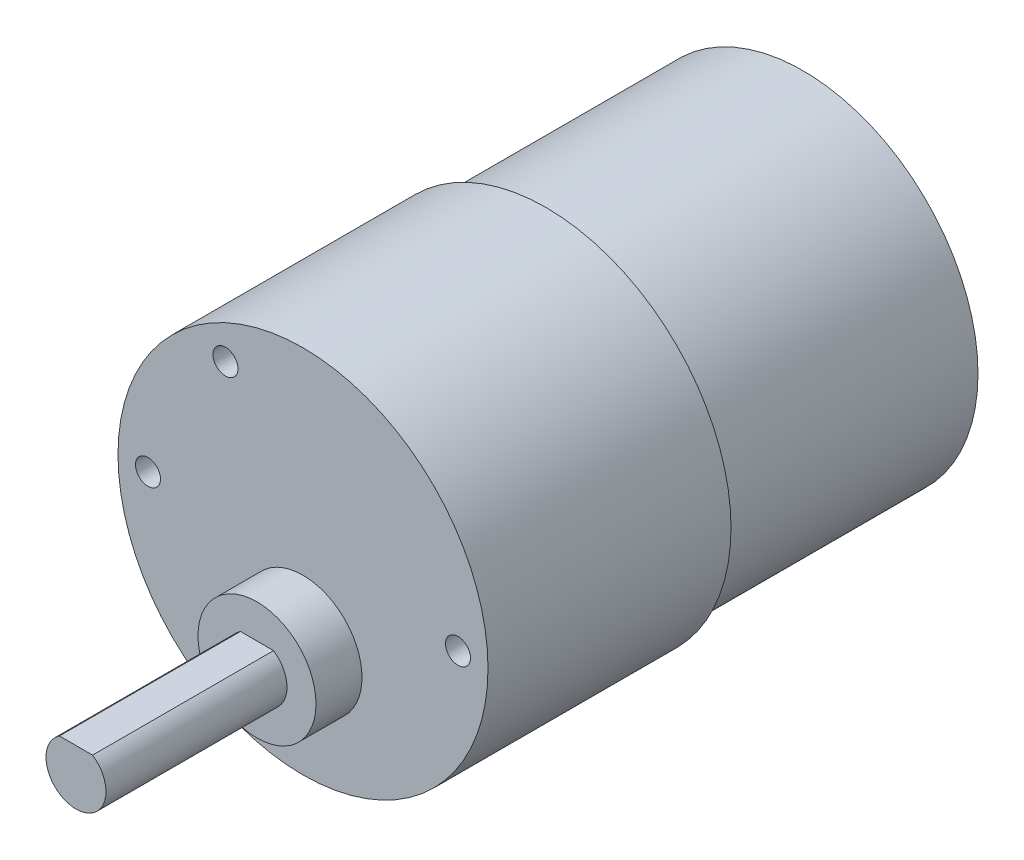
ISO-10303-21;
HEADER;
FILE_DESCRIPTION(('STEP AP214'),'2;1');
FILE_NAME('part.step','',(''),(''),'','','');
FILE_SCHEMA(('AUTOMOTIVE_DESIGN { 1 0 10303 214 1 1 1 1 }'));
ENDSEC;
DATA;
#1=APPLICATION_CONTEXT('core data for automotive mechanical design processes');
#2=APPLICATION_PROTOCOL_DEFINITION('international standard','automotive_design',2000,#1);
#3=PRODUCT_CONTEXT('',#1,'mechanical');
#4=PRODUCT('Part','Part','',(#3));
#5=PRODUCT_RELATED_PRODUCT_CATEGORY('part','',(#4));
#6=PRODUCT_DEFINITION_FORMATION('','',#4);
#7=PRODUCT_DEFINITION_CONTEXT('part definition',#1,'design');
#8=PRODUCT_DEFINITION('design','',#6,#7);
#9=PRODUCT_DEFINITION_SHAPE('','',#8);
#10=(LENGTH_UNIT() NAMED_UNIT(*) SI_UNIT(.MILLI.,.METRE.));
#11=(NAMED_UNIT(*) PLANE_ANGLE_UNIT() SI_UNIT($,.RADIAN.));
#12=(NAMED_UNIT(*) SI_UNIT($,.STERADIAN.) SOLID_ANGLE_UNIT());
#13=UNCERTAINTY_MEASURE_WITH_UNIT(LENGTH_MEASURE(1.E-05),#10,'distance_accuracy_value','');
#14=(GEOMETRIC_REPRESENTATION_CONTEXT(3) GLOBAL_UNCERTAINTY_ASSIGNED_CONTEXT((#13)) GLOBAL_UNIT_ASSIGNED_CONTEXT((#10,
#11,#12)) REPRESENTATION_CONTEXT('',''));
#15=CARTESIAN_POINT('',(0.,0.,0.));
#16=DIRECTION('',(0.,0.,1.));
#17=DIRECTION('',(1.,0.,0.));
#18=AXIS2_PLACEMENT_3D('',#15,#16,#17);
#19=CARTESIAN_POINT('',(0.,0.,0.));
#20=DIRECTION('',(0.,0.,-1.));
#21=DIRECTION('',(-1.,0.,0.));
#22=AXIS2_PLACEMENT_3D('',#19,#20,#21);
#23=PLANE('',#22);
#24=CARTESIAN_POINT('',(-15.5,0.,0.));
#25=DIRECTION('',(0.,0.,1.));
#26=DIRECTION('',(1.,0.,0.));
#27=AXIS2_PLACEMENT_3D('',#24,#25,#26);
#28=CIRCLE('',#27,1.25);
#29=CARTESIAN_POINT('',(-14.25,0.,0.));
#30=VERTEX_POINT('',#29);
#31=EDGE_CURVE('E91',#30,#30,#28,.T.);
#32=ORIENTED_EDGE('',*,*,#31,.F.);
#33=EDGE_LOOP('',(#32));
#34=FACE_BOUND('',#33,.T.);
#35=CARTESIAN_POINT('',(-7.75,13.4233937586588,0.));
#36=DIRECTION('',(0.,0.,1.));
#37=DIRECTION('',(1.,0.,0.));
#38=AXIS2_PLACEMENT_3D('',#35,#36,#37);
#39=CIRCLE('',#38,1.25);
#40=CARTESIAN_POINT('',(-6.5,13.4233937586588,0.));
#41=VERTEX_POINT('',#40);
#42=EDGE_CURVE('E90',#41,#41,#39,.T.);
#43=ORIENTED_EDGE('',*,*,#42,.F.);
#44=EDGE_LOOP('',(#43));
#45=FACE_BOUND('',#44,.T.);
#46=CARTESIAN_POINT('',(-7.75,-13.4233937586588,0.));
#47=DIRECTION('',(0.,0.,1.));
#48=DIRECTION('',(1.,0.,0.));
#49=AXIS2_PLACEMENT_3D('',#46,#47,#48);
#50=CIRCLE('',#49,1.25);
#51=CARTESIAN_POINT('',(-6.5,-13.4233937586588,0.));
#52=VERTEX_POINT('',#51);
#53=EDGE_CURVE('E101',#52,#52,#50,.T.);
#54=ORIENTED_EDGE('',*,*,#53,.F.);
#55=EDGE_LOOP('',(#54));
#56=FACE_BOUND('',#55,.T.);
#57=CARTESIAN_POINT('',(15.5,0.,0.));
#58=DIRECTION('',(0.,0.,1.));
#59=DIRECTION('',(1.,0.,0.));
#60=AXIS2_PLACEMENT_3D('',#57,#58,#59);
#61=CIRCLE('',#60,1.25);
#62=CARTESIAN_POINT('',(16.75,0.,0.));
#63=VERTEX_POINT('',#62);
#64=EDGE_CURVE('E107',#63,#63,#61,.T.);
#65=ORIENTED_EDGE('',*,*,#64,.F.);
#66=EDGE_LOOP('',(#65));
#67=FACE_BOUND('',#66,.T.);
#68=CARTESIAN_POINT('',(0.,-7.1,0.));
#69=DIRECTION('',(0.,0.,-1.));
#70=DIRECTION('',(-1.,0.,0.));
#71=AXIS2_PLACEMENT_3D('',#68,#69,#70);
#72=CIRCLE('',#71,5.9);
#73=CARTESIAN_POINT('',(-5.9,-7.1,0.));
#74=VERTEX_POINT('',#73);
#75=EDGE_CURVE('E12',#74,#74,#72,.F.);
#76=ORIENTED_EDGE('',*,*,#75,.F.);
#77=EDGE_LOOP('',(#76));
#78=FACE_BOUND('',#77,.T.);
#79=CARTESIAN_POINT('',(0.,0.,0.));
#80=DIRECTION('',(0.,0.,1.));
#81=DIRECTION('',(1.,0.,0.));
#82=AXIS2_PLACEMENT_3D('',#79,#80,#81);
#83=CIRCLE('',#82,18.5);
#84=CARTESIAN_POINT('',(18.5,0.,0.));
#85=VERTEX_POINT('',#84);
#86=EDGE_CURVE('E136',#85,#85,#83,.T.);
#87=ORIENTED_EDGE('',*,*,#86,.T.);
#88=EDGE_LOOP('',(#87));
#89=FACE_BOUND('',#88,.T.);
#90=ADVANCED_FACE('F41',(#34,#45,#56,#67,#78,#89),#23,.F.);
#91=CARTESIAN_POINT('',(0.,0.,0.));
#92=DIRECTION('',(0.,0.,1.));
#93=DIRECTION('',(1.,0.,0.));
#94=AXIS2_PLACEMENT_3D('',#91,#92,#93);
#95=CYLINDRICAL_SURFACE('',#94,18.5);
#96=ORIENTED_EDGE('',*,*,#86,.F.);
#97=EDGE_LOOP('',(#96));
#98=FACE_BOUND('',#97,.T.);
#99=CARTESIAN_POINT('',(0.,0.,-24.3));
#100=DIRECTION('',(0.,0.,1.));
#101=DIRECTION('',(1.,0.,0.));
#102=AXIS2_PLACEMENT_3D('',#99,#100,#101);
#103=CIRCLE('',#102,18.5);
#104=CARTESIAN_POINT('',(18.5,0.,-24.3));
#105=VERTEX_POINT('',#104);
#106=EDGE_CURVE('E133',#105,#105,#103,.T.);
#107=ORIENTED_EDGE('',*,*,#106,.T.);
#108=EDGE_LOOP('',(#107));
#109=FACE_BOUND('',#108,.T.);
#110=ADVANCED_FACE('F157',(#98,#109),#95,.T.);
#111=CARTESIAN_POINT('',(0.,18.5,-24.3));
#112=DIRECTION('',(0.,0.,1.));
#113=DIRECTION('',(1.,0.,0.));
#114=AXIS2_PLACEMENT_3D('',#111,#112,#113);
#115=PLANE('',#114);
#116=ORIENTED_EDGE('',*,*,#106,.F.);
#117=EDGE_LOOP('',(#116));
#118=FACE_BOUND('',#117,.T.);
#119=CARTESIAN_POINT('',(0.,0.,-24.3));
#120=DIRECTION('',(0.,0.,1.));
#121=DIRECTION('',(1.,0.,0.));
#122=AXIS2_PLACEMENT_3D('',#119,#120,#121);
#123=CIRCLE('',#122,17.5);
#124=CARTESIAN_POINT('',(17.5,0.,-24.3));
#125=VERTEX_POINT('',#124);
#126=EDGE_CURVE('E130',#125,#125,#123,.T.);
#127=ORIENTED_EDGE('',*,*,#126,.T.);
#128=EDGE_LOOP('',(#127));
#129=FACE_BOUND('',#128,.T.);
#130=ADVANCED_FACE('F162',(#118,#129),#115,.F.);
#131=CARTESIAN_POINT('',(0.,0.,0.));
#132=DIRECTION('',(0.,0.,1.));
#133=DIRECTION('',(1.,0.,0.));
#134=AXIS2_PLACEMENT_3D('',#131,#132,#133);
#135=CYLINDRICAL_SURFACE('',#134,17.5);
#136=ORIENTED_EDGE('',*,*,#126,.F.);
#137=EDGE_LOOP('',(#136));
#138=FACE_BOUND('',#137,.T.);
#139=CARTESIAN_POINT('',(0.,0.,-50.));
#140=DIRECTION('',(0.,0.,1.));
#141=DIRECTION('',(1.,0.,0.));
#142=AXIS2_PLACEMENT_3D('',#139,#140,#141);
#143=CIRCLE('',#142,17.5);
#144=CARTESIAN_POINT('',(17.5,0.,-50.));
#145=VERTEX_POINT('',#144);
#146=EDGE_CURVE('E120',#145,#145,#143,.T.);
#147=ORIENTED_EDGE('',*,*,#146,.T.);
#148=EDGE_LOOP('',(#147));
#149=FACE_BOUND('',#148,.T.);
#150=ADVANCED_FACE('F180',(#138,#149),#135,.T.);
#151=CARTESIAN_POINT('',(0.,17.5,-50.));
#152=DIRECTION('',(0.,0.,1.));
#153=DIRECTION('',(1.,0.,0.));
#154=AXIS2_PLACEMENT_3D('',#151,#152,#153);
#155=PLANE('',#154);
#156=ORIENTED_EDGE('',*,*,#146,.F.);
#157=EDGE_LOOP('',(#156));
#158=FACE_BOUND('',#157,.T.);
#159=ADVANCED_FACE('F186',(#158),#155,.F.);
#160=CARTESIAN_POINT('',(0.,17.5,4.6));
#161=DIRECTION('',(0.,0.,1.));
#162=DIRECTION('',(1.,0.,0.));
#163=AXIS2_PLACEMENT_3D('',#160,#161,#162);
#164=PLANE('',#163);
#165=CARTESIAN_POINT('',(0.,-7.1,4.59999999999999));
#166=DIRECTION('',(0.,0.,1.));
#167=DIRECTION('',(1.,0.,0.));
#168=AXIS2_PLACEMENT_3D('',#165,#166,#167);
#169=CIRCLE('',#168,5.9);
#170=CARTESIAN_POINT('',(5.9,-7.1,4.59999999999999));
#171=VERTEX_POINT('',#170);
#172=EDGE_CURVE('E113',#171,#171,#169,.T.);
#173=ORIENTED_EDGE('',*,*,#172,.T.);
#174=EDGE_LOOP('',(#173));
#175=FACE_BOUND('',#174,.T.);
#176=CARTESIAN_POINT('',(0.,-7.1,4.59999999999999));
#177=DIRECTION('',(0.,0.,1.));
#178=DIRECTION('',(1.,0.,0.));
#179=AXIS2_PLACEMENT_3D('',#176,#177,#178);
#180=CIRCLE('',#179,3.);
#181=CARTESIAN_POINT('',(-1.6583123951777,-4.6,4.59999999999999));
#182=VERTEX_POINT('',#181);
#183=CARTESIAN_POINT('',(1.6583123951777,-4.6,4.59999999999999));
#184=VERTEX_POINT('',#183);
#185=EDGE_CURVE('E54',#182,#184,#180,.T.);
#186=ORIENTED_EDGE('',*,*,#185,.F.);
#187=DIRECTION('',(-1.,0.,0.));
#188=VECTOR('',#187,1.);
#189=CARTESIAN_POINT('',(-1.6583123951777,-4.6,4.59999999999999));
#190=LINE('',#189,#188);
#191=EDGE_CURVE('E48',#184,#182,#190,.T.);
#192=ORIENTED_EDGE('',*,*,#191,.F.);
#193=EDGE_LOOP('',(#186,#192));
#194=FACE_BOUND('',#193,.T.);
#195=ADVANCED_FACE('F151',(#175,#194),#164,.T.);
#196=CARTESIAN_POINT('',(0.,-7.1,39.3877200360025));
#197=DIRECTION('',(0.,0.,-1.));
#198=DIRECTION('',(-1.,0.,0.));
#199=AXIS2_PLACEMENT_3D('',#196,#197,#198);
#200=CYLINDRICAL_SURFACE('',#199,5.9);
#201=ORIENTED_EDGE('',*,*,#75,.T.);
#202=EDGE_LOOP('',(#201));
#203=FACE_BOUND('',#202,.T.);
#204=ORIENTED_EDGE('',*,*,#172,.F.);
#205=EDGE_LOOP('',(#204));
#206=FACE_BOUND('',#205,.T.);
#207=ADVANCED_FACE('F144',(#203,#206),#200,.T.);
#208=CARTESIAN_POINT('',(0.,17.5,22.7));
#209=DIRECTION('',(0.,0.,1.));
#210=DIRECTION('',(1.,0.,0.));
#211=AXIS2_PLACEMENT_3D('',#208,#209,#210);
#212=PLANE('',#211);
#213=DIRECTION('',(-1.,0.,0.));
#214=VECTOR('',#213,1.);
#215=CARTESIAN_POINT('',(-1.6583123951777,-4.6,22.7));
#216=LINE('',#215,#214);
#217=CARTESIAN_POINT('',(1.6583123951777,-4.6,22.7));
#218=VERTEX_POINT('',#217);
#219=CARTESIAN_POINT('',(-1.6583123951777,-4.6,22.7));
#220=VERTEX_POINT('',#219);
#221=EDGE_CURVE('E121',#218,#220,#216,.T.);
#222=ORIENTED_EDGE('',*,*,#221,.T.);
#223=CARTESIAN_POINT('',(0.,-7.1,22.7));
#224=DIRECTION('',(0.,0.,1.));
#225=DIRECTION('',(1.,0.,0.));
#226=AXIS2_PLACEMENT_3D('',#223,#224,#225);
#227=CIRCLE('',#226,3.);
#228=EDGE_CURVE('E117',#220,#218,#227,.T.);
#229=ORIENTED_EDGE('',*,*,#228,.T.);
#230=EDGE_LOOP('',(#222,#229));
#231=FACE_BOUND('',#230,.T.);
#232=ADVANCED_FACE('F142',(#231),#212,.T.);
#233=CARTESIAN_POINT('',(-1.6583123951777,-4.6,103.53941029805));
#234=DIRECTION('',(0.,-1.,0.));
#235=DIRECTION('',(0.,0.,-1.));
#236=AXIS2_PLACEMENT_3D('',#233,#234,#235);
#237=PLANE('',#236);
#238=DIRECTION('',(0.,0.,-1.));
#239=VECTOR('',#238,1.);
#240=CARTESIAN_POINT('',(1.6583123951777,-4.6,103.53941029805));
#241=LINE('',#240,#239);
#242=EDGE_CURVE('E124',#218,#184,#241,.T.);
#243=ORIENTED_EDGE('',*,*,#242,.T.);
#244=ORIENTED_EDGE('',*,*,#191,.T.);
#245=DIRECTION('',(0.,0.,-1.));
#246=VECTOR('',#245,1.);
#247=CARTESIAN_POINT('',(-1.6583123951777,-4.6,103.53941029805));
#248=LINE('',#247,#246);
#249=EDGE_CURVE('E61',#220,#182,#248,.T.);
#250=ORIENTED_EDGE('',*,*,#249,.F.);
#251=ORIENTED_EDGE('',*,*,#221,.F.);
#252=EDGE_LOOP('',(#243,#244,#250,#251));
#253=FACE_BOUND('',#252,.T.);
#254=ADVANCED_FACE('F138',(#253),#237,.F.);
#255=CARTESIAN_POINT('',(0.,-7.1,103.53941029805));
#256=DIRECTION('',(0.,0.,-1.));
#257=DIRECTION('',(-1.,0.,0.));
#258=AXIS2_PLACEMENT_3D('',#255,#256,#257);
#259=CYLINDRICAL_SURFACE('',#258,3.);
#260=ORIENTED_EDGE('',*,*,#249,.T.);
#261=ORIENTED_EDGE('',*,*,#185,.T.);
#262=ORIENTED_EDGE('',*,*,#242,.F.);
#263=ORIENTED_EDGE('',*,*,#228,.F.);
#264=EDGE_LOOP('',(#260,#261,#262,#263));
#265=FACE_BOUND('',#264,.T.);
#266=ADVANCED_FACE('F140',(#265),#259,.T.);
#267=CARTESIAN_POINT('',(15.5,0.,-3.));
#268=DIRECTION('',(0.,0.,1.));
#269=DIRECTION('',(1.,0.,0.));
#270=AXIS2_PLACEMENT_3D('',#267,#268,#269);
#271=CONICAL_SURFACE('',#270,1.25,1.02974425867665);
#272=CARTESIAN_POINT('',(15.5,0.,-3.75107577378445));
#273=VERTEX_POINT('',#272);
#274=VERTEX_LOOP('',#273);
#275=FACE_BOUND('',#274,.T.);
#276=CARTESIAN_POINT('',(15.5,0.,-3.));
#277=DIRECTION('',(0.,0.,1.));
#278=DIRECTION('',(1.,0.,0.));
#279=AXIS2_PLACEMENT_3D('',#276,#277,#278);
#280=CIRCLE('',#279,1.25);
#281=CARTESIAN_POINT('',(16.75,0.,-3.));
#282=VERTEX_POINT('',#281);
#283=EDGE_CURVE('E110',#282,#282,#280,.T.);
#284=ORIENTED_EDGE('',*,*,#283,.T.);
#285=EDGE_LOOP('',(#284));
#286=FACE_BOUND('',#285,.T.);
#287=ADVANCED_FACE('F200',(#275,#286),#271,.F.);
#288=CARTESIAN_POINT('',(15.5,0.,0.));
#289=DIRECTION('',(0.,0.,1.));
#290=DIRECTION('',(1.,0.,0.));
#291=AXIS2_PLACEMENT_3D('',#288,#289,#290);
#292=CYLINDRICAL_SURFACE('',#291,1.25);
#293=ORIENTED_EDGE('',*,*,#283,.F.);
#294=EDGE_LOOP('',(#293));
#295=FACE_BOUND('',#294,.T.);
#296=ORIENTED_EDGE('',*,*,#64,.T.);
#297=EDGE_LOOP('',(#296));
#298=FACE_BOUND('',#297,.T.);
#299=ADVANCED_FACE('F204',(#295,#298),#292,.F.);
#300=CARTESIAN_POINT('',(-7.75,-13.4233937586588,-3.));
#301=DIRECTION('',(0.,0.,1.));
#302=DIRECTION('',(1.,0.,0.));
#303=AXIS2_PLACEMENT_3D('',#300,#301,#302);
#304=CONICAL_SURFACE('',#303,1.25,1.02974425867665);
#305=CARTESIAN_POINT('',(-7.75,-13.4233937586588,-3.75107577378445));
#306=VERTEX_POINT('',#305);
#307=VERTEX_LOOP('',#306);
#308=FACE_BOUND('',#307,.T.);
#309=CARTESIAN_POINT('',(-7.75,-13.4233937586588,-3.));
#310=DIRECTION('',(0.,0.,1.));
#311=DIRECTION('',(1.,0.,0.));
#312=AXIS2_PLACEMENT_3D('',#309,#310,#311);
#313=CIRCLE('',#312,1.25);
#314=CARTESIAN_POINT('',(-6.5,-13.4233937586588,-3.));
#315=VERTEX_POINT('',#314);
#316=EDGE_CURVE('E104',#315,#315,#313,.T.);
#317=ORIENTED_EDGE('',*,*,#316,.T.);
#318=EDGE_LOOP('',(#317));
#319=FACE_BOUND('',#318,.T.);
#320=ADVANCED_FACE('F209',(#308,#319),#304,.F.);
#321=CARTESIAN_POINT('',(-7.75,-13.4233937586588,0.));
#322=DIRECTION('',(0.,0.,1.));
#323=DIRECTION('',(1.,0.,0.));
#324=AXIS2_PLACEMENT_3D('',#321,#322,#323);
#325=CYLINDRICAL_SURFACE('',#324,1.25);
#326=ORIENTED_EDGE('',*,*,#316,.F.);
#327=EDGE_LOOP('',(#326));
#328=FACE_BOUND('',#327,.T.);
#329=ORIENTED_EDGE('',*,*,#53,.T.);
#330=EDGE_LOOP('',(#329));
#331=FACE_BOUND('',#330,.T.);
#332=ADVANCED_FACE('F216',(#328,#331),#325,.F.);
#333=CARTESIAN_POINT('',(-7.75,13.4233937586588,-3.));
#334=DIRECTION('',(0.,0.,1.));
#335=DIRECTION('',(1.,0.,0.));
#336=AXIS2_PLACEMENT_3D('',#333,#334,#335);
#337=CONICAL_SURFACE('',#336,1.25,1.02974425867665);
#338=CARTESIAN_POINT('',(-7.75,13.4233937586588,-3.75107577378445));
#339=VERTEX_POINT('',#338);
#340=VERTEX_LOOP('',#339);
#341=FACE_BOUND('',#340,.T.);
#342=CARTESIAN_POINT('',(-7.75,13.4233937586588,-3.));
#343=DIRECTION('',(0.,0.,1.));
#344=DIRECTION('',(1.,0.,0.));
#345=AXIS2_PLACEMENT_3D('',#342,#343,#344);
#346=CIRCLE('',#345,1.25);
#347=CARTESIAN_POINT('',(-6.5,13.4233937586588,-3.));
#348=VERTEX_POINT('',#347);
#349=EDGE_CURVE('E94',#348,#348,#346,.T.);
#350=ORIENTED_EDGE('',*,*,#349,.T.);
#351=EDGE_LOOP('',(#350));
#352=FACE_BOUND('',#351,.T.);
#353=ADVANCED_FACE('F220',(#341,#352),#337,.F.);
#354=CARTESIAN_POINT('',(-7.75,13.4233937586588,0.));
#355=DIRECTION('',(0.,0.,1.));
#356=DIRECTION('',(1.,0.,0.));
#357=AXIS2_PLACEMENT_3D('',#354,#355,#356);
#358=CYLINDRICAL_SURFACE('',#357,1.25);
#359=ORIENTED_EDGE('',*,*,#349,.F.);
#360=EDGE_LOOP('',(#359));
#361=FACE_BOUND('',#360,.T.);
#362=ORIENTED_EDGE('',*,*,#42,.T.);
#363=EDGE_LOOP('',(#362));
#364=FACE_BOUND('',#363,.T.);
#365=ADVANCED_FACE('F84',(#361,#364),#358,.F.);
#366=CARTESIAN_POINT('',(-15.5,0.,-3.));
#367=DIRECTION('',(0.,0.,1.));
#368=DIRECTION('',(1.,0.,0.));
#369=AXIS2_PLACEMENT_3D('',#366,#367,#368);
#370=CONICAL_SURFACE('',#369,1.25,1.02974425867665);
#371=CARTESIAN_POINT('',(-15.5,0.,-3.75107577378445));
#372=VERTEX_POINT('',#371);
#373=VERTEX_LOOP('',#372);
#374=FACE_BOUND('',#373,.T.);
#375=CARTESIAN_POINT('',(-15.5,0.,-3.));
#376=DIRECTION('',(0.,0.,1.));
#377=DIRECTION('',(1.,0.,0.));
#378=AXIS2_PLACEMENT_3D('',#375,#376,#377);
#379=CIRCLE('',#378,1.25);
#380=CARTESIAN_POINT('',(-14.25,0.,-3.));
#381=VERTEX_POINT('',#380);
#382=EDGE_CURVE('E88',#381,#381,#379,.T.);
#383=ORIENTED_EDGE('',*,*,#382,.T.);
#384=EDGE_LOOP('',(#383));
#385=FACE_BOUND('',#384,.T.);
#386=ADVANCED_FACE('F80',(#374,#385),#370,.F.);
#387=CARTESIAN_POINT('',(-15.5,0.,0.));
#388=DIRECTION('',(0.,0.,1.));
#389=DIRECTION('',(1.,0.,0.));
#390=AXIS2_PLACEMENT_3D('',#387,#388,#389);
#391=CYLINDRICAL_SURFACE('',#390,1.25);
#392=ORIENTED_EDGE('',*,*,#382,.F.);
#393=EDGE_LOOP('',(#392));
#394=FACE_BOUND('',#393,.T.);
#395=ORIENTED_EDGE('',*,*,#31,.T.);
#396=EDGE_LOOP('',(#395));
#397=FACE_BOUND('',#396,.T.);
#398=ADVANCED_FACE('F83',(#394,#397),#391,.F.);
#399=CLOSED_SHELL('',(#90,#110,#130,#150,#159,#195,#207,#232,#254,#266,#287,#299,#320,#332,#353,
#365,#386,#398));
#400=MANIFOLD_SOLID_BREP('B2',#399);
#401=ADVANCED_BREP_SHAPE_REPRESENTATION('',(#18,#400),#14);
#402=SHAPE_DEFINITION_REPRESENTATION(#9,#401);
ENDSEC;
END-ISO-10303-21;
